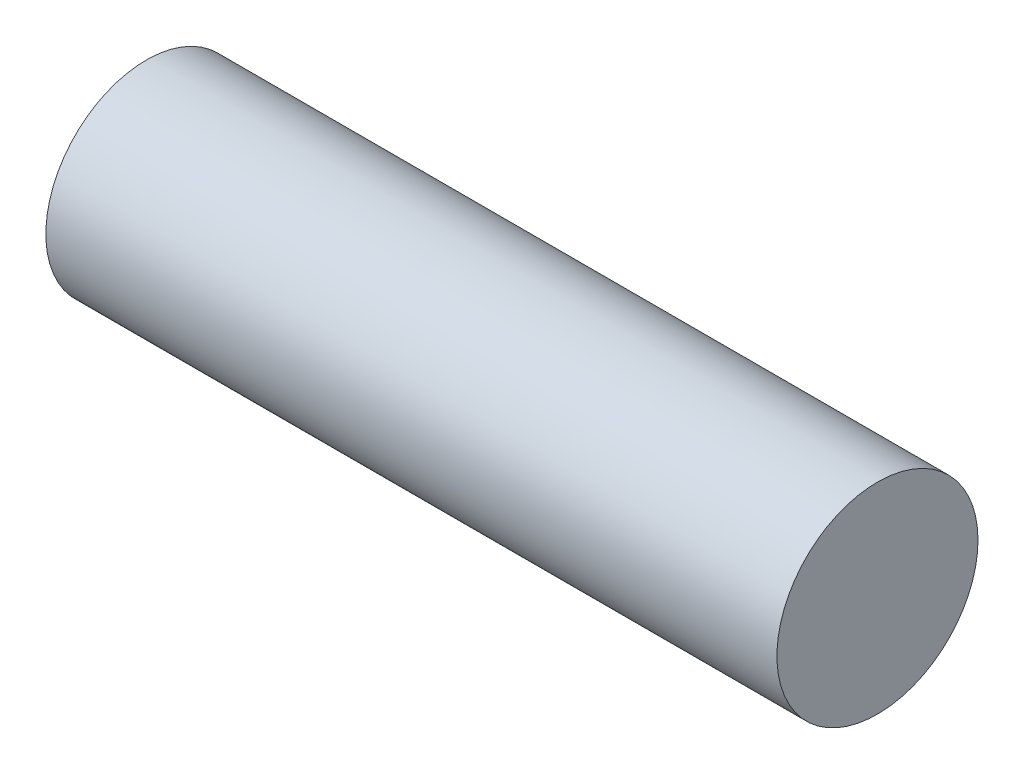
ISO-10303-21;
HEADER;
FILE_DESCRIPTION(('STEP AP214'),'2;1');
FILE_NAME('part.step','',(''),(''),'','','');
FILE_SCHEMA(('AUTOMOTIVE_DESIGN { 1 0 10303 214 1 1 1 1 }'));
ENDSEC;
DATA;
#1=APPLICATION_CONTEXT('core data for automotive mechanical design processes');
#2=APPLICATION_PROTOCOL_DEFINITION('international standard','automotive_design',2000,#1);
#3=PRODUCT_CONTEXT('',#1,'mechanical');
#4=PRODUCT('Part','Part','',(#3));
#5=PRODUCT_RELATED_PRODUCT_CATEGORY('part','',(#4));
#6=PRODUCT_DEFINITION_FORMATION('','',#4);
#7=PRODUCT_DEFINITION_CONTEXT('part definition',#1,'design');
#8=PRODUCT_DEFINITION('design','',#6,#7);
#9=PRODUCT_DEFINITION_SHAPE('','',#8);
#10=(LENGTH_UNIT() NAMED_UNIT(*) SI_UNIT(.MILLI.,.METRE.));
#11=(NAMED_UNIT(*) PLANE_ANGLE_UNIT() SI_UNIT($,.RADIAN.));
#12=(NAMED_UNIT(*) SI_UNIT($,.STERADIAN.) SOLID_ANGLE_UNIT());
#13=UNCERTAINTY_MEASURE_WITH_UNIT(LENGTH_MEASURE(1.E-05),#10,'distance_accuracy_value','');
#14=(GEOMETRIC_REPRESENTATION_CONTEXT(3) GLOBAL_UNCERTAINTY_ASSIGNED_CONTEXT((#13)) GLOBAL_UNIT_ASSIGNED_CONTEXT((#10,
#11,#12)) REPRESENTATION_CONTEXT('',''));
#15=CARTESIAN_POINT('',(0.,0.,0.));
#16=DIRECTION('',(0.,0.,1.));
#17=DIRECTION('',(1.,0.,0.));
#18=AXIS2_PLACEMENT_3D('',#15,#16,#17);
#19=CARTESIAN_POINT('',(400.,0.,0.));
#20=DIRECTION('',(-1.,0.,0.));
#21=DIRECTION('',(0.,0.,1.));
#22=AXIS2_PLACEMENT_3D('',#19,#20,#21);
#23=CYLINDRICAL_SURFACE('',#22,55.);
#24=CARTESIAN_POINT('',(400.,0.,0.));
#25=DIRECTION('',(1.,0.,0.));
#26=DIRECTION('',(0.,0.,-1.));
#27=AXIS2_PLACEMENT_3D('',#24,#25,#26);
#28=CIRCLE('',#27,55.);
#29=CARTESIAN_POINT('',(400.,0.,-55.));
#30=VERTEX_POINT('',#29);
#31=EDGE_CURVE('E10',#30,#30,#28,.T.);
#32=ORIENTED_EDGE('',*,*,#31,.F.);
#33=EDGE_LOOP('',(#32));
#34=FACE_BOUND('',#33,.T.);
#35=CARTESIAN_POINT('',(0.,0.,0.));
#36=DIRECTION('',(1.,0.,0.));
#37=DIRECTION('',(0.,0.,-1.));
#38=AXIS2_PLACEMENT_3D('',#35,#36,#37);
#39=CIRCLE('',#38,55.);
#40=CARTESIAN_POINT('',(0.,0.,-55.));
#41=VERTEX_POINT('',#40);
#42=EDGE_CURVE('E41',#41,#41,#39,.T.);
#43=ORIENTED_EDGE('',*,*,#42,.T.);
#44=EDGE_LOOP('',(#43));
#45=FACE_BOUND('',#44,.T.);
#46=ADVANCED_FACE('F38',(#34,#45),#23,.T.);
#47=CARTESIAN_POINT('',(400.,0.,0.));
#48=DIRECTION('',(1.,0.,0.));
#49=DIRECTION('',(0.,0.,-1.));
#50=AXIS2_PLACEMENT_3D('',#47,#48,#49);
#51=PLANE('',#50);
#52=ORIENTED_EDGE('',*,*,#31,.T.);
#53=EDGE_LOOP('',(#52));
#54=FACE_BOUND('',#53,.T.);
#55=ADVANCED_FACE('F55',(#54),#51,.T.);
#56=CARTESIAN_POINT('',(0.,0.,0.));
#57=DIRECTION('',(1.,0.,0.));
#58=DIRECTION('',(0.,0.,-1.));
#59=AXIS2_PLACEMENT_3D('',#56,#57,#58);
#60=PLANE('',#59);
#61=ORIENTED_EDGE('',*,*,#42,.F.);
#62=EDGE_LOOP('',(#61));
#63=FACE_BOUND('',#62,.T.);
#64=ADVANCED_FACE('F53',(#63),#60,.F.);
#65=CLOSED_SHELL('',(#46,#55,#64));
#66=MANIFOLD_SOLID_BREP('B2',#65);
#67=ADVANCED_BREP_SHAPE_REPRESENTATION('',(#18,#66),#14);
#68=SHAPE_DEFINITION_REPRESENTATION(#9,#67);
ENDSEC;
END-ISO-10303-21;
